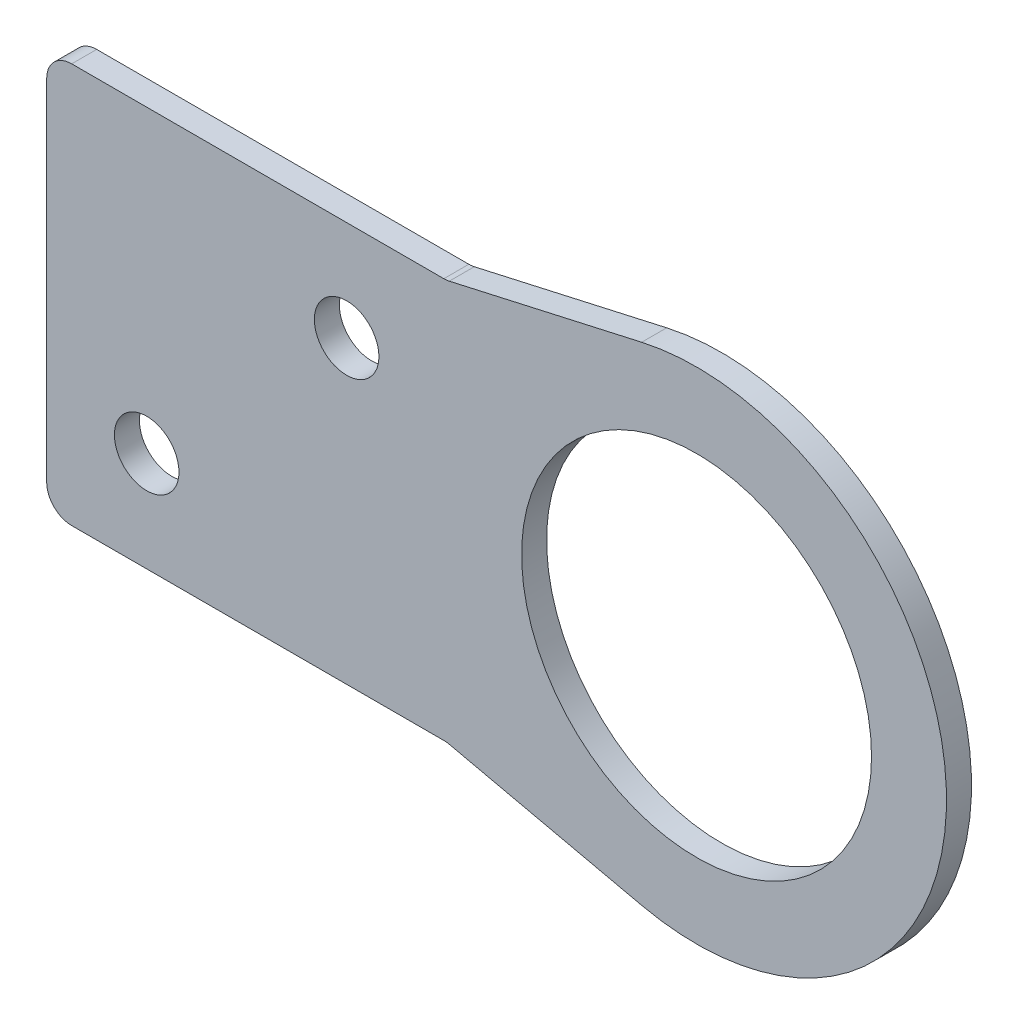
ISO-10303-21;
HEADER;
FILE_DESCRIPTION(('STEP AP214'),'2;1');
FILE_NAME('part.step','',(''),(''),'','','');
FILE_SCHEMA(('AUTOMOTIVE_DESIGN { 1 0 10303 214 1 1 1 1 }'));
ENDSEC;
DATA;
#1=APPLICATION_CONTEXT('core data for automotive mechanical design processes');
#2=APPLICATION_PROTOCOL_DEFINITION('international standard','automotive_design',2000,#1);
#3=PRODUCT_CONTEXT('',#1,'mechanical');
#4=PRODUCT('Part','Part','',(#3));
#5=PRODUCT_RELATED_PRODUCT_CATEGORY('part','',(#4));
#6=PRODUCT_DEFINITION_FORMATION('','',#4);
#7=PRODUCT_DEFINITION_CONTEXT('part definition',#1,'design');
#8=PRODUCT_DEFINITION('design','',#6,#7);
#9=PRODUCT_DEFINITION_SHAPE('','',#8);
#10=(LENGTH_UNIT() NAMED_UNIT(*) SI_UNIT(.MILLI.,.METRE.));
#11=(NAMED_UNIT(*) PLANE_ANGLE_UNIT() SI_UNIT($,.RADIAN.));
#12=(NAMED_UNIT(*) SI_UNIT($,.STERADIAN.) SOLID_ANGLE_UNIT());
#13=UNCERTAINTY_MEASURE_WITH_UNIT(LENGTH_MEASURE(1.E-05),#10,'distance_accuracy_value','');
#14=(GEOMETRIC_REPRESENTATION_CONTEXT(3) GLOBAL_UNCERTAINTY_ASSIGNED_CONTEXT((#13)) GLOBAL_UNIT_ASSIGNED_CONTEXT((#10,
#11,#12)) REPRESENTATION_CONTEXT('',''));
#15=CARTESIAN_POINT('',(0.,0.,0.));
#16=DIRECTION('',(0.,0.,1.));
#17=DIRECTION('',(1.,0.,0.));
#18=AXIS2_PLACEMENT_3D('',#15,#16,#17);
#19=CARTESIAN_POINT('',(0.,12.7,1.5875));
#20=DIRECTION('',(0.,-1.,0.));
#21=DIRECTION('',(1.,0.,0.));
#22=AXIS2_PLACEMENT_3D('',#19,#20,#21);
#23=PLANE('',#22);
#24=DIRECTION('',(-1.,0.,0.));
#25=VECTOR('',#24,1.);
#26=CARTESIAN_POINT('',(0.,12.7,1.5875));
#27=LINE('',#26,#25);
#28=CARTESIAN_POINT('',(164.923611111111,12.7,1.5875));
#29=VERTEX_POINT('',#28);
#30=CARTESIAN_POINT('',(141.2875,12.7,1.5875));
#31=VERTEX_POINT('',#30);
#32=EDGE_CURVE('E346',#29,#31,#27,.T.);
#33=ORIENTED_EDGE('',*,*,#32,.F.);
#34=DIRECTION('',(0.,0.,-1.));
#35=VECTOR('',#34,1.);
#36=CARTESIAN_POINT('',(164.923611111111,12.7,1.5875));
#37=LINE('',#36,#35);
#38=CARTESIAN_POINT('',(164.923611111111,12.7,0.));
#39=VERTEX_POINT('',#38);
#40=EDGE_CURVE('E182',#29,#39,#37,.T.);
#41=ORIENTED_EDGE('',*,*,#40,.T.);
#42=DIRECTION('',(-1.,0.,0.));
#43=VECTOR('',#42,1.);
#44=CARTESIAN_POINT('',(0.,12.7,0.));
#45=LINE('',#44,#43);
#46=CARTESIAN_POINT('',(141.2875,12.7,0.));
#47=VERTEX_POINT('',#46);
#48=EDGE_CURVE('E160',#39,#47,#45,.T.);
#49=ORIENTED_EDGE('',*,*,#48,.T.);
#50=DIRECTION('',(0.,0.,-1.));
#51=VECTOR('',#50,1.);
#52=CARTESIAN_POINT('',(141.2875,12.7,1.5875));
#53=LINE('',#52,#51);
#54=EDGE_CURVE('E141',#47,#31,#53,.F.);
#55=ORIENTED_EDGE('',*,*,#54,.T.);
#56=EDGE_LOOP('',(#33,#41,#49,#55));
#57=FACE_BOUND('',#56,.T.);
#58=ADVANCED_FACE('F41',(#57),#23,.F.);
#59=CARTESIAN_POINT('',(139.7,0.,1.5875));
#60=DIRECTION('',(1.,0.,0.));
#61=DIRECTION('',(0.,0.,-1.));
#62=AXIS2_PLACEMENT_3D('',#59,#60,#61);
#63=PLANE('',#62);
#64=DIRECTION('',(0.,-1.,0.));
#65=VECTOR('',#64,1.);
#66=CARTESIAN_POINT('',(139.7,0.,0.));
#67=LINE('',#66,#65);
#68=CARTESIAN_POINT('',(139.7,11.1125,0.));
#69=VERTEX_POINT('',#68);
#70=CARTESIAN_POINT('',(139.7,-11.1125,0.));
#71=VERTEX_POINT('',#70);
#72=EDGE_CURVE('E163',#69,#71,#67,.T.);
#73=ORIENTED_EDGE('',*,*,#72,.T.);
#74=DIRECTION('',(0.,0.,-1.));
#75=VECTOR('',#74,1.);
#76=CARTESIAN_POINT('',(139.7,-11.1125,1.5875));
#77=LINE('',#76,#75);
#78=CARTESIAN_POINT('',(139.7,-11.1125,1.5875));
#79=VERTEX_POINT('',#78);
#80=EDGE_CURVE('E56',#71,#79,#77,.F.);
#81=ORIENTED_EDGE('',*,*,#80,.T.);
#82=DIRECTION('',(0.,-1.,0.));
#83=VECTOR('',#82,1.);
#84=CARTESIAN_POINT('',(139.7,0.,1.5875));
#85=LINE('',#84,#83);
#86=CARTESIAN_POINT('',(139.7,11.1125,1.5875));
#87=VERTEX_POINT('',#86);
#88=EDGE_CURVE('E343',#87,#79,#85,.T.);
#89=ORIENTED_EDGE('',*,*,#88,.F.);
#90=DIRECTION('',(0.,0.,-1.));
#91=VECTOR('',#90,1.);
#92=CARTESIAN_POINT('',(139.7,11.1125,1.5875));
#93=LINE('',#92,#91);
#94=EDGE_CURVE('E198',#87,#69,#93,.T.);
#95=ORIENTED_EDGE('',*,*,#94,.T.);
#96=EDGE_LOOP('',(#73,#81,#89,#95));
#97=FACE_BOUND('',#96,.T.);
#98=ADVANCED_FACE('F231',(#97),#63,.F.);
#99=CARTESIAN_POINT('',(0.,-12.7,1.5875));
#100=DIRECTION('',(0.,-1.,0.));
#101=DIRECTION('',(1.,0.,0.));
#102=AXIS2_PLACEMENT_3D('',#99,#100,#101);
#103=PLANE('',#102);
#104=DIRECTION('',(-1.,0.,0.));
#105=VECTOR('',#104,1.);
#106=CARTESIAN_POINT('',(0.,-12.7,0.));
#107=LINE('',#106,#105);
#108=CARTESIAN_POINT('',(164.923611111111,-12.7,0.));
#109=VERTEX_POINT('',#108);
#110=CARTESIAN_POINT('',(141.2875,-12.7,0.));
#111=VERTEX_POINT('',#110);
#112=EDGE_CURVE('E165',#109,#111,#107,.T.);
#113=ORIENTED_EDGE('',*,*,#112,.F.);
#114=DIRECTION('',(0.,0.,-1.));
#115=VECTOR('',#114,1.);
#116=CARTESIAN_POINT('',(164.923611111111,-12.7,1.5875));
#117=LINE('',#116,#115);
#118=CARTESIAN_POINT('',(164.923611111111,-12.7,1.5875));
#119=VERTEX_POINT('',#118);
#120=EDGE_CURVE('E192',#109,#119,#117,.F.);
#121=ORIENTED_EDGE('',*,*,#120,.T.);
#122=DIRECTION('',(-1.,0.,0.));
#123=VECTOR('',#122,1.);
#124=CARTESIAN_POINT('',(0.,-12.7,1.5875));
#125=LINE('',#124,#123);
#126=CARTESIAN_POINT('',(141.2875,-12.7,1.5875));
#127=VERTEX_POINT('',#126);
#128=EDGE_CURVE('E131',#119,#127,#125,.T.);
#129=ORIENTED_EDGE('',*,*,#128,.T.);
#130=DIRECTION('',(0.,0.,-1.));
#131=VECTOR('',#130,1.);
#132=CARTESIAN_POINT('',(141.2875,-12.7,0.));
#133=LINE('',#132,#131);
#134=EDGE_CURVE('E189',#127,#111,#133,.T.);
#135=ORIENTED_EDGE('',*,*,#134,.T.);
#136=EDGE_LOOP('',(#113,#121,#129,#135));
#137=FACE_BOUND('',#136,.T.);
#138=ADVANCED_FACE('F215',(#137),#103,.T.);
#139=CARTESIAN_POINT('',(5.23563355145738,23.2694824509218,1.5875));
#140=DIRECTION('',(0.21951219512195,0.975609756097561,0.));
#141=DIRECTION('',(-0.975609756097561,0.21951219512195,0.));
#142=AXIS2_PLACEMENT_3D('',#139,#140,#141);
#143=PLANE('',#142);
#144=DIRECTION('',(0.975609756097561,-0.21951219512195,0.));
#145=VECTOR('',#144,1.);
#146=CARTESIAN_POINT('',(5.23563355145738,23.2694824509218,1.5875));
#147=LINE('',#146,#145);
#148=CARTESIAN_POINT('',(165.272086720867,-12.7387195121951,1.5875));
#149=VERTEX_POINT('',#148);
#150=CARTESIAN_POINT('',(177.490243902439,-15.4878048780488,1.5875));
#151=VERTEX_POINT('',#150);
#152=EDGE_CURVE('E118',#149,#151,#147,.T.);
#153=ORIENTED_EDGE('',*,*,#152,.F.);
#154=DIRECTION('',(0.,0.,-1.));
#155=VECTOR('',#154,1.);
#156=CARTESIAN_POINT('',(165.272086720867,-12.7387195121951,1.5875));
#157=LINE('',#156,#155);
#158=CARTESIAN_POINT('',(165.272086720867,-12.7387195121951,0.));
#159=VERTEX_POINT('',#158);
#160=EDGE_CURVE('E187',#149,#159,#157,.T.);
#161=ORIENTED_EDGE('',*,*,#160,.T.);
#162=DIRECTION('',(0.975609756097561,-0.21951219512195,0.));
#163=VECTOR('',#162,1.);
#164=CARTESIAN_POINT('',(5.23563355145738,23.2694824509218,0.));
#165=LINE('',#164,#163);
#166=CARTESIAN_POINT('',(177.490243902439,-15.4878048780488,0.));
#167=VERTEX_POINT('',#166);
#168=EDGE_CURVE('E137',#159,#167,#165,.T.);
#169=ORIENTED_EDGE('',*,*,#168,.T.);
#170=DIRECTION('',(0.,0.,-1.));
#171=VECTOR('',#170,1.);
#172=CARTESIAN_POINT('',(177.490243902439,-15.4878048780488,1.5875));
#173=LINE('',#172,#171);
#174=EDGE_CURVE('E134',#151,#167,#173,.T.);
#175=ORIENTED_EDGE('',*,*,#174,.F.);
#176=EDGE_LOOP('',(#153,#161,#169,#175));
#177=FACE_BOUND('',#176,.T.);
#178=ADVANCED_FACE('F135',(#177),#143,.F.);
#179=CARTESIAN_POINT('',(180.975,0.,1.5875));
#180=DIRECTION('',(0.,0.,-1.));
#181=DIRECTION('',(-1.,0.,0.));
#182=AXIS2_PLACEMENT_3D('',#179,#180,#181);
#183=CYLINDRICAL_SURFACE('',#182,15.875);
#184=CARTESIAN_POINT('',(180.975,0.,0.));
#185=DIRECTION('',(0.,0.,1.));
#186=DIRECTION('',(1.,0.,0.));
#187=AXIS2_PLACEMENT_3D('',#184,#185,#186);
#188=CIRCLE('',#187,15.875);
#189=CARTESIAN_POINT('',(177.490243902439,15.4878048780488,0.));
#190=VERTEX_POINT('',#189);
#191=EDGE_CURVE('E169',#167,#190,#188,.T.);
#192=ORIENTED_EDGE('',*,*,#191,.T.);
#193=DIRECTION('',(0.,0.,-1.));
#194=VECTOR('',#193,1.);
#195=CARTESIAN_POINT('',(177.490243902439,15.4878048780488,1.5875));
#196=LINE('',#195,#194);
#197=CARTESIAN_POINT('',(177.490243902439,15.4878048780488,1.5875));
#198=VERTEX_POINT('',#197);
#199=EDGE_CURVE('E142',#198,#190,#196,.T.);
#200=ORIENTED_EDGE('',*,*,#199,.F.);
#201=CARTESIAN_POINT('',(180.975,0.,1.5875));
#202=DIRECTION('',(0.,0.,1.));
#203=DIRECTION('',(1.,0.,0.));
#204=AXIS2_PLACEMENT_3D('',#201,#202,#203);
#205=CIRCLE('',#204,15.875);
#206=EDGE_CURVE('E124',#151,#198,#205,.T.);
#207=ORIENTED_EDGE('',*,*,#206,.F.);
#208=ORIENTED_EDGE('',*,*,#174,.T.);
#209=EDGE_LOOP('',(#192,#200,#207,#208));
#210=FACE_BOUND('',#209,.T.);
#211=ADVANCED_FACE('F144',(#210),#183,.T.);
#212=CARTESIAN_POINT('',(158.75,6.35000000000004,1.5875));
#213=DIRECTION('',(0.,0.,-1.));
#214=DIRECTION('',(-1.,0.,0.));
#215=AXIS2_PLACEMENT_3D('',#212,#213,#214);
#216=CYLINDRICAL_SURFACE('',#215,2.04999999999999);
#217=CARTESIAN_POINT('',(158.75,6.35000000000004,1.5875));
#218=DIRECTION('',(0.,0.,1.));
#219=DIRECTION('',(1.,0.,0.));
#220=AXIS2_PLACEMENT_3D('',#217,#218,#219);
#221=CIRCLE('',#220,2.04999999999999);
#222=CARTESIAN_POINT('',(160.8,6.35000000000004,1.5875));
#223=VERTEX_POINT('',#222);
#224=EDGE_CURVE('E148',#223,#223,#221,.F.);
#225=ORIENTED_EDGE('',*,*,#224,.F.);
#226=EDGE_LOOP('',(#225));
#227=FACE_BOUND('',#226,.T.);
#228=CARTESIAN_POINT('',(158.75,6.35000000000004,0.));
#229=DIRECTION('',(0.,0.,1.));
#230=DIRECTION('',(1.,0.,0.));
#231=AXIS2_PLACEMENT_3D('',#228,#229,#230);
#232=CIRCLE('',#231,2.04999999999999);
#233=CARTESIAN_POINT('',(160.8,6.35000000000004,0.));
#234=VERTEX_POINT('',#233);
#235=EDGE_CURVE('E173',#234,#234,#232,.F.);
#236=ORIENTED_EDGE('',*,*,#235,.T.);
#237=EDGE_LOOP('',(#236));
#238=FACE_BOUND('',#237,.T.);
#239=ADVANCED_FACE('F253',(#227,#238),#216,.F.);
#240=CARTESIAN_POINT('',(5.23563355145741,-23.2694824509219,1.5875));
#241=DIRECTION('',(-0.21951219512195,0.975609756097561,0.));
#242=DIRECTION('',(-0.975609756097561,-0.21951219512195,0.));
#243=AXIS2_PLACEMENT_3D('',#240,#241,#242);
#244=PLANE('',#243);
#245=DIRECTION('',(0.975609756097561,0.21951219512195,0.));
#246=VECTOR('',#245,1.);
#247=CARTESIAN_POINT('',(5.23563355145741,-23.2694824509219,0.));
#248=LINE('',#247,#246);
#249=CARTESIAN_POINT('',(165.272086720867,12.7387195121951,0.));
#250=VERTEX_POINT('',#249);
#251=EDGE_CURVE('E171',#250,#190,#248,.T.);
#252=ORIENTED_EDGE('',*,*,#251,.F.);
#253=DIRECTION('',(0.,0.,-1.));
#254=VECTOR('',#253,1.);
#255=CARTESIAN_POINT('',(165.272086720867,12.7387195121951,1.5875));
#256=LINE('',#255,#254);
#257=CARTESIAN_POINT('',(165.272086720867,12.7387195121951,1.5875));
#258=VERTEX_POINT('',#257);
#259=EDGE_CURVE('E185',#250,#258,#256,.F.);
#260=ORIENTED_EDGE('',*,*,#259,.T.);
#261=DIRECTION('',(0.975609756097561,0.21951219512195,0.));
#262=VECTOR('',#261,1.);
#263=CARTESIAN_POINT('',(5.23563355145741,-23.2694824509219,1.5875));
#264=LINE('',#263,#262);
#265=EDGE_CURVE('E146',#258,#198,#264,.T.);
#266=ORIENTED_EDGE('',*,*,#265,.T.);
#267=ORIENTED_EDGE('',*,*,#199,.T.);
#268=EDGE_LOOP('',(#252,#260,#266,#267));
#269=FACE_BOUND('',#268,.T.);
#270=ADVANCED_FACE('F245',(#269),#244,.T.);
#271=CARTESIAN_POINT('',(146.05,-6.34999999999996,1.5875));
#272=DIRECTION('',(0.,0.,-1.));
#273=DIRECTION('',(-1.,0.,0.));
#274=AXIS2_PLACEMENT_3D('',#271,#272,#273);
#275=CYLINDRICAL_SURFACE('',#274,2.04999999999999);
#276=CARTESIAN_POINT('',(146.05,-6.34999999999996,1.5875));
#277=DIRECTION('',(0.,0.,1.));
#278=DIRECTION('',(1.,0.,0.));
#279=AXIS2_PLACEMENT_3D('',#276,#277,#278);
#280=CIRCLE('',#279,2.04999999999999);
#281=CARTESIAN_POINT('',(148.1,-6.34999999999996,1.5875));
#282=VERTEX_POINT('',#281);
#283=EDGE_CURVE('E179',#282,#282,#280,.F.);
#284=ORIENTED_EDGE('',*,*,#283,.F.);
#285=EDGE_LOOP('',(#284));
#286=FACE_BOUND('',#285,.T.);
#287=CARTESIAN_POINT('',(146.05,-6.34999999999996,0.));
#288=DIRECTION('',(0.,0.,1.));
#289=DIRECTION('',(1.,0.,0.));
#290=AXIS2_PLACEMENT_3D('',#287,#288,#289);
#291=CIRCLE('',#290,2.04999999999999);
#292=CARTESIAN_POINT('',(148.1,-6.34999999999996,0.));
#293=VERTEX_POINT('',#292);
#294=EDGE_CURVE('E157',#293,#293,#291,.F.);
#295=ORIENTED_EDGE('',*,*,#294,.T.);
#296=EDGE_LOOP('',(#295));
#297=FACE_BOUND('',#296,.T.);
#298=ADVANCED_FACE('F242',(#286,#297),#275,.F.);
#299=CARTESIAN_POINT('',(180.975,0.,1.5875));
#300=DIRECTION('',(0.,0.,-1.));
#301=DIRECTION('',(-1.,0.,0.));
#302=AXIS2_PLACEMENT_3D('',#299,#300,#301);
#303=CYLINDRICAL_SURFACE('',#302,11.1125);
#304=CARTESIAN_POINT('',(180.975,0.,1.5875));
#305=DIRECTION('',(0.,0.,1.));
#306=DIRECTION('',(1.,0.,0.));
#307=AXIS2_PLACEMENT_3D('',#304,#305,#306);
#308=CIRCLE('',#307,11.1125);
#309=CARTESIAN_POINT('',(192.0875,0.,1.5875));
#310=VERTEX_POINT('',#309);
#311=EDGE_CURVE('E154',#310,#310,#308,.T.);
#312=ORIENTED_EDGE('',*,*,#311,.T.);
#313=EDGE_LOOP('',(#312));
#314=FACE_BOUND('',#313,.T.);
#315=CARTESIAN_POINT('',(180.975,0.,0.));
#316=DIRECTION('',(0.,0.,1.));
#317=DIRECTION('',(1.,0.,0.));
#318=AXIS2_PLACEMENT_3D('',#315,#316,#317);
#319=CIRCLE('',#318,11.1125);
#320=CARTESIAN_POINT('',(192.0875,0.,0.));
#321=VERTEX_POINT('',#320);
#322=EDGE_CURVE('E176',#321,#321,#319,.T.);
#323=ORIENTED_EDGE('',*,*,#322,.F.);
#324=EDGE_LOOP('',(#323));
#325=FACE_BOUND('',#324,.T.);
#326=ADVANCED_FACE('F244',(#314,#325),#303,.F.);
#327=CARTESIAN_POINT('',(0.,0.,1.5875));
#328=DIRECTION('',(0.,0.,1.));
#329=DIRECTION('',(1.,0.,0.));
#330=AXIS2_PLACEMENT_3D('',#327,#328,#329);
#331=PLANE('',#330);
#332=ORIENTED_EDGE('',*,*,#283,.T.);
#333=EDGE_LOOP('',(#332));
#334=FACE_BOUND('',#333,.T.);
#335=ORIENTED_EDGE('',*,*,#88,.T.);
#336=CARTESIAN_POINT('',(141.2875,-11.1125,1.5875));
#337=DIRECTION('',(0.,0.,1.));
#338=DIRECTION('',(1.,0.,0.));
#339=AXIS2_PLACEMENT_3D('',#336,#337,#338);
#340=CIRCLE('',#339,1.5875);
#341=EDGE_CURVE('E203',#79,#127,#340,.T.);
#342=ORIENTED_EDGE('',*,*,#341,.T.);
#343=ORIENTED_EDGE('',*,*,#128,.F.);
#344=CARTESIAN_POINT('',(164.923611111111,-14.2875,1.5875));
#345=DIRECTION('',(0.,0.,1.));
#346=DIRECTION('',(1.,0.,0.));
#347=AXIS2_PLACEMENT_3D('',#344,#345,#346);
#348=CIRCLE('',#347,1.5875);
#349=EDGE_CURVE('E11',#119,#149,#348,.F.);
#350=ORIENTED_EDGE('',*,*,#349,.T.);
#351=ORIENTED_EDGE('',*,*,#152,.T.);
#352=ORIENTED_EDGE('',*,*,#206,.T.);
#353=ORIENTED_EDGE('',*,*,#265,.F.);
#354=CARTESIAN_POINT('',(164.923611111111,14.2875,1.5875));
#355=DIRECTION('',(0.,0.,1.));
#356=DIRECTION('',(1.,0.,0.));
#357=AXIS2_PLACEMENT_3D('',#354,#355,#356);
#358=CIRCLE('',#357,1.5875);
#359=EDGE_CURVE('E207',#258,#29,#358,.F.);
#360=ORIENTED_EDGE('',*,*,#359,.T.);
#361=ORIENTED_EDGE('',*,*,#32,.T.);
#362=CARTESIAN_POINT('',(141.2875,11.1125,1.5875));
#363=DIRECTION('',(0.,0.,1.));
#364=DIRECTION('',(1.,0.,0.));
#365=AXIS2_PLACEMENT_3D('',#362,#363,#364);
#366=CIRCLE('',#365,1.5875);
#367=EDGE_CURVE('E63',#31,#87,#366,.T.);
#368=ORIENTED_EDGE('',*,*,#367,.T.);
#369=EDGE_LOOP('',(#335,#342,#343,#350,#351,#352,#353,#360,#361,#368));
#370=FACE_BOUND('',#369,.T.);
#371=ORIENTED_EDGE('',*,*,#224,.T.);
#372=EDGE_LOOP('',(#371));
#373=FACE_BOUND('',#372,.T.);
#374=ORIENTED_EDGE('',*,*,#311,.F.);
#375=EDGE_LOOP('',(#374));
#376=FACE_BOUND('',#375,.T.);
#377=ADVANCED_FACE('F120',(#334,#370,#373,#376),#331,.T.);
#378=CARTESIAN_POINT('',(0.,0.,0.));
#379=DIRECTION('',(0.,0.,1.));
#380=DIRECTION('',(1.,0.,0.));
#381=AXIS2_PLACEMENT_3D('',#378,#379,#380);
#382=PLANE('',#381);
#383=ORIENTED_EDGE('',*,*,#294,.F.);
#384=EDGE_LOOP('',(#383));
#385=FACE_BOUND('',#384,.T.);
#386=ORIENTED_EDGE('',*,*,#112,.T.);
#387=CARTESIAN_POINT('',(141.2875,-11.1125,0.));
#388=DIRECTION('',(0.,0.,1.));
#389=DIRECTION('',(1.,0.,0.));
#390=AXIS2_PLACEMENT_3D('',#387,#388,#389);
#391=CIRCLE('',#390,1.5875);
#392=EDGE_CURVE('E196',#111,#71,#391,.F.);
#393=ORIENTED_EDGE('',*,*,#392,.T.);
#394=ORIENTED_EDGE('',*,*,#72,.F.);
#395=CARTESIAN_POINT('',(141.2875,11.1125,0.));
#396=DIRECTION('',(0.,0.,1.));
#397=DIRECTION('',(1.,0.,0.));
#398=AXIS2_PLACEMENT_3D('',#395,#396,#397);
#399=CIRCLE('',#398,1.5875);
#400=EDGE_CURVE('E194',#69,#47,#399,.F.);
#401=ORIENTED_EDGE('',*,*,#400,.T.);
#402=ORIENTED_EDGE('',*,*,#48,.F.);
#403=CARTESIAN_POINT('',(164.923611111111,14.2875,0.));
#404=DIRECTION('',(0.,0.,1.));
#405=DIRECTION('',(1.,0.,0.));
#406=AXIS2_PLACEMENT_3D('',#403,#404,#405);
#407=CIRCLE('',#406,1.5875);
#408=EDGE_CURVE('E205',#39,#250,#407,.T.);
#409=ORIENTED_EDGE('',*,*,#408,.T.);
#410=ORIENTED_EDGE('',*,*,#251,.T.);
#411=ORIENTED_EDGE('',*,*,#191,.F.);
#412=ORIENTED_EDGE('',*,*,#168,.F.);
#413=CARTESIAN_POINT('',(164.923611111111,-14.2875,0.));
#414=DIRECTION('',(0.,0.,1.));
#415=DIRECTION('',(1.,0.,0.));
#416=AXIS2_PLACEMENT_3D('',#413,#414,#415);
#417=CIRCLE('',#416,1.5875);
#418=EDGE_CURVE('E49',#159,#109,#417,.T.);
#419=ORIENTED_EDGE('',*,*,#418,.T.);
#420=EDGE_LOOP('',(#386,#393,#394,#401,#402,#409,#410,#411,#412,#419));
#421=FACE_BOUND('',#420,.T.);
#422=ORIENTED_EDGE('',*,*,#235,.F.);
#423=EDGE_LOOP('',(#422));
#424=FACE_BOUND('',#423,.T.);
#425=ORIENTED_EDGE('',*,*,#322,.T.);
#426=EDGE_LOOP('',(#425));
#427=FACE_BOUND('',#426,.T.);
#428=ADVANCED_FACE('F210',(#385,#421,#424,#427),#382,.F.);
#429=CARTESIAN_POINT('',(164.923611111111,14.2875,1.5875));
#430=DIRECTION('',(0.,0.,-1.));
#431=DIRECTION('',(-1.,0.,0.));
#432=AXIS2_PLACEMENT_3D('',#429,#430,#431);
#433=CYLINDRICAL_SURFACE('',#432,1.5875);
#434=ORIENTED_EDGE('',*,*,#359,.F.);
#435=ORIENTED_EDGE('',*,*,#259,.F.);
#436=ORIENTED_EDGE('',*,*,#408,.F.);
#437=ORIENTED_EDGE('',*,*,#40,.F.);
#438=EDGE_LOOP('',(#434,#435,#436,#437));
#439=FACE_BOUND('',#438,.T.);
#440=ADVANCED_FACE('F221',(#439),#433,.F.);
#441=CARTESIAN_POINT('',(164.923611111111,-14.2875,1.5875));
#442=DIRECTION('',(0.,0.,-1.));
#443=DIRECTION('',(-1.,0.,0.));
#444=AXIS2_PLACEMENT_3D('',#441,#442,#443);
#445=CYLINDRICAL_SURFACE('',#444,1.5875);
#446=ORIENTED_EDGE('',*,*,#349,.F.);
#447=ORIENTED_EDGE('',*,*,#120,.F.);
#448=ORIENTED_EDGE('',*,*,#418,.F.);
#449=ORIENTED_EDGE('',*,*,#160,.F.);
#450=EDGE_LOOP('',(#446,#447,#448,#449));
#451=FACE_BOUND('',#450,.T.);
#452=ADVANCED_FACE('F218',(#451),#445,.F.);
#453=CARTESIAN_POINT('',(141.2875,-11.1125,1.5875));
#454=DIRECTION('',(0.,0.,1.));
#455=DIRECTION('',(1.,0.,0.));
#456=AXIS2_PLACEMENT_3D('',#453,#454,#455);
#457=CYLINDRICAL_SURFACE('',#456,1.5875);
#458=ORIENTED_EDGE('',*,*,#341,.F.);
#459=ORIENTED_EDGE('',*,*,#80,.F.);
#460=ORIENTED_EDGE('',*,*,#392,.F.);
#461=ORIENTED_EDGE('',*,*,#134,.F.);
#462=EDGE_LOOP('',(#458,#459,#460,#461));
#463=FACE_BOUND('',#462,.T.);
#464=ADVANCED_FACE('F220',(#463),#457,.T.);
#465=CARTESIAN_POINT('',(141.2875,11.1125,1.5875));
#466=DIRECTION('',(0.,0.,-1.));
#467=DIRECTION('',(-1.,0.,0.));
#468=AXIS2_PLACEMENT_3D('',#465,#466,#467);
#469=CYLINDRICAL_SURFACE('',#468,1.5875);
#470=ORIENTED_EDGE('',*,*,#367,.F.);
#471=ORIENTED_EDGE('',*,*,#54,.F.);
#472=ORIENTED_EDGE('',*,*,#400,.F.);
#473=ORIENTED_EDGE('',*,*,#94,.F.);
#474=EDGE_LOOP('',(#470,#471,#472,#473));
#475=FACE_BOUND('',#474,.T.);
#476=ADVANCED_FACE('F43',(#475),#469,.T.);
#477=CLOSED_SHELL('',(#58,#98,#138,#178,#211,#239,#270,#298,#326,#377,#428,#440,#452,#464,#476));
#478=MANIFOLD_SOLID_BREP('B2',#477);
#479=ADVANCED_BREP_SHAPE_REPRESENTATION('',(#18,#478),#14);
#480=SHAPE_DEFINITION_REPRESENTATION(#9,#479);
ENDSEC;
END-ISO-10303-21;
